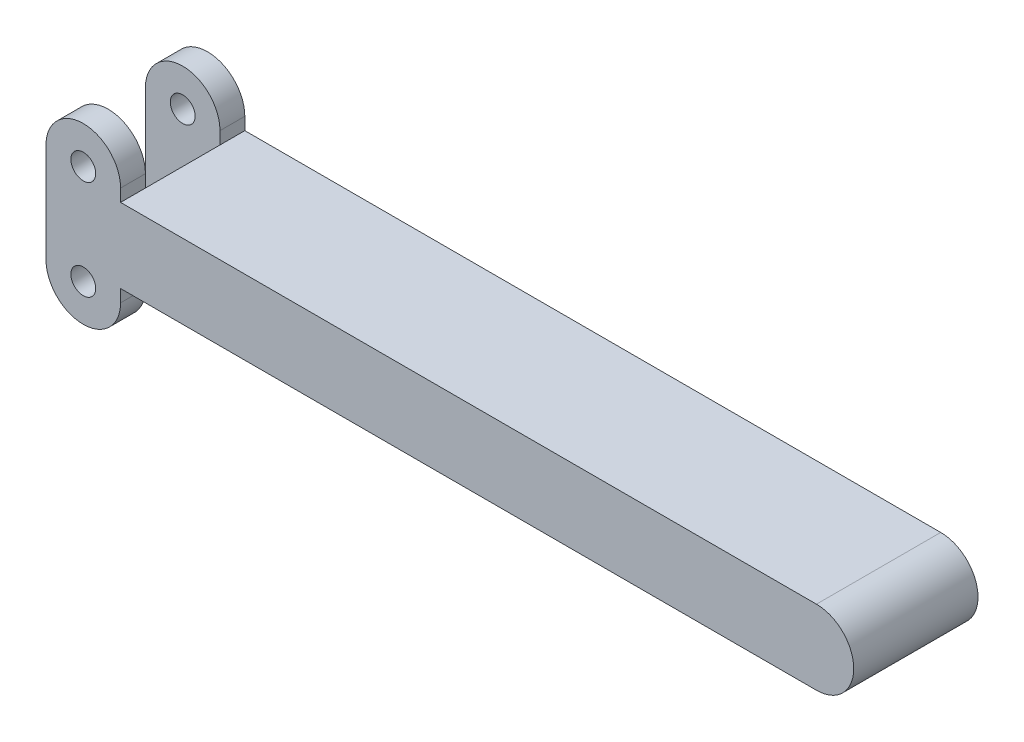
ISO-10303-21;
HEADER;
FILE_DESCRIPTION(('STEP AP214'),'2;1');
FILE_NAME('part.step','',(''),(''),'','','');
FILE_SCHEMA(('AUTOMOTIVE_DESIGN { 1 0 10303 214 1 1 1 1 }'));
ENDSEC;
DATA;
#1=APPLICATION_CONTEXT('core data for automotive mechanical design processes');
#2=APPLICATION_PROTOCOL_DEFINITION('international standard','automotive_design',2000,#1);
#3=PRODUCT_CONTEXT('',#1,'mechanical');
#4=PRODUCT('Part','Part','',(#3));
#5=PRODUCT_RELATED_PRODUCT_CATEGORY('part','',(#4));
#6=PRODUCT_DEFINITION_FORMATION('','',#4);
#7=PRODUCT_DEFINITION_CONTEXT('part definition',#1,'design');
#8=PRODUCT_DEFINITION('design','',#6,#7);
#9=PRODUCT_DEFINITION_SHAPE('','',#8);
#10=(LENGTH_UNIT() NAMED_UNIT(*) SI_UNIT(.MILLI.,.METRE.));
#11=(NAMED_UNIT(*) PLANE_ANGLE_UNIT() SI_UNIT($,.RADIAN.));
#12=(NAMED_UNIT(*) SI_UNIT($,.STERADIAN.) SOLID_ANGLE_UNIT());
#13=UNCERTAINTY_MEASURE_WITH_UNIT(LENGTH_MEASURE(1.E-05),#10,'distance_accuracy_value','');
#14=(GEOMETRIC_REPRESENTATION_CONTEXT(3) GLOBAL_UNCERTAINTY_ASSIGNED_CONTEXT((#13)) GLOBAL_UNIT_ASSIGNED_CONTEXT((#10,
#11,#12)) REPRESENTATION_CONTEXT('',''));
#15=CARTESIAN_POINT('',(0.,0.,0.));
#16=DIRECTION('',(0.,0.,1.));
#17=DIRECTION('',(1.,0.,0.));
#18=AXIS2_PLACEMENT_3D('',#15,#16,#17);
#19=CARTESIAN_POINT('',(9.525,0.,31.75));
#20=DIRECTION('',(-1.,0.,0.));
#21=DIRECTION('',(0.,-1.,0.));
#22=AXIS2_PLACEMENT_3D('',#19,#20,#21);
#23=PLANE('',#22);
#24=DIRECTION('',(0.,-1.,0.));
#25=VECTOR('',#24,1.);
#26=CARTESIAN_POINT('',(9.525,0.,25.4));
#27=LINE('',#26,#25);
#28=CARTESIAN_POINT('',(9.525,25.4,25.4));
#29=VERTEX_POINT('',#28);
#30=CARTESIAN_POINT('',(9.525,22.225,25.4));
#31=VERTEX_POINT('',#30);
#32=EDGE_CURVE('E187',#29,#31,#27,.T.);
#33=ORIENTED_EDGE('',*,*,#32,.F.);
#34=DIRECTION('',(0.,0.,-1.));
#35=VECTOR('',#34,1.);
#36=CARTESIAN_POINT('',(9.525,25.4,31.75));
#37=LINE('',#36,#35);
#38=CARTESIAN_POINT('',(9.525,25.4,31.75));
#39=VERTEX_POINT('',#38);
#40=EDGE_CURVE('E212',#39,#29,#37,.T.);
#41=ORIENTED_EDGE('',*,*,#40,.F.);
#42=DIRECTION('',(0.,1.,0.));
#43=VECTOR('',#42,1.);
#44=CARTESIAN_POINT('',(9.525,0.,31.75));
#45=LINE('',#44,#43);
#46=CARTESIAN_POINT('',(9.525,22.225,31.75));
#47=VERTEX_POINT('',#46);
#48=EDGE_CURVE('E140',#47,#39,#45,.T.);
#49=ORIENTED_EDGE('',*,*,#48,.F.);
#50=DIRECTION('',(0.,0.,-1.));
#51=VECTOR('',#50,1.);
#52=CARTESIAN_POINT('',(9.525,22.225,31.75));
#53=LINE('',#52,#51);
#54=EDGE_CURVE('E43',#47,#31,#53,.T.);
#55=ORIENTED_EDGE('',*,*,#54,.T.);
#56=EDGE_LOOP('',(#33,#41,#49,#55));
#57=FACE_BOUND('',#56,.T.);
#58=ADVANCED_FACE('F34',(#57),#23,.F.);
#59=CARTESIAN_POINT('',(0.,25.4,31.75));
#60=DIRECTION('',(0.,0.,-1.));
#61=DIRECTION('',(-1.,0.,0.));
#62=AXIS2_PLACEMENT_3D('',#59,#60,#61);
#63=CYLINDRICAL_SURFACE('',#62,9.525);
#64=CARTESIAN_POINT('',(0.,25.4,25.4));
#65=DIRECTION('',(0.,0.,-1.));
#66=DIRECTION('',(0.,1.,0.));
#67=AXIS2_PLACEMENT_3D('',#64,#65,#66);
#68=CIRCLE('',#67,9.525);
#69=CARTESIAN_POINT('',(-9.525,25.4,25.4));
#70=VERTEX_POINT('',#69);
#71=EDGE_CURVE('E160',#70,#29,#68,.T.);
#72=ORIENTED_EDGE('',*,*,#71,.F.);
#73=DIRECTION('',(0.,0.,-1.));
#74=VECTOR('',#73,1.);
#75=CARTESIAN_POINT('',(-9.52500000000001,25.4,31.75));
#76=LINE('',#75,#74);
#77=CARTESIAN_POINT('',(-9.52500000000001,25.4,31.75));
#78=VERTEX_POINT('',#77);
#79=EDGE_CURVE('E258',#78,#70,#76,.T.);
#80=ORIENTED_EDGE('',*,*,#79,.F.);
#81=CARTESIAN_POINT('',(0.,25.4,31.75));
#82=DIRECTION('',(0.,0.,1.));
#83=DIRECTION('',(1.,0.,0.));
#84=AXIS2_PLACEMENT_3D('',#81,#82,#83);
#85=CIRCLE('',#84,9.525);
#86=EDGE_CURVE('E145',#39,#78,#85,.T.);
#87=ORIENTED_EDGE('',*,*,#86,.F.);
#88=ORIENTED_EDGE('',*,*,#40,.T.);
#89=EDGE_LOOP('',(#72,#80,#87,#88));
#90=FACE_BOUND('',#89,.T.);
#91=ADVANCED_FACE('F314',(#90),#63,.T.);
#92=CARTESIAN_POINT('',(0.,25.4,6.35));
#93=DIRECTION('',(0.,0.,-1.));
#94=DIRECTION('',(0.,1.,0.));
#95=AXIS2_PLACEMENT_3D('',#92,#93,#94);
#96=CIRCLE('',#95,9.525);
#97=CARTESIAN_POINT('',(-9.525,25.4,6.35));
#98=VERTEX_POINT('',#97);
#99=CARTESIAN_POINT('',(9.525,25.4,6.35));
#100=VERTEX_POINT('',#99);
#101=EDGE_CURVE('E167',#98,#100,#96,.T.);
#102=ORIENTED_EDGE('',*,*,#101,.T.);
#103=CARTESIAN_POINT('',(9.525,25.4,0.));
#104=VERTEX_POINT('',#103);
#105=EDGE_CURVE('E226',#100,#104,#37,.T.);
#106=ORIENTED_EDGE('',*,*,#105,.T.);
#107=CARTESIAN_POINT('',(0.,25.4,0.));
#108=DIRECTION('',(0.,0.,1.));
#109=DIRECTION('',(1.,0.,0.));
#110=AXIS2_PLACEMENT_3D('',#107,#108,#109);
#111=CIRCLE('',#110,9.525);
#112=CARTESIAN_POINT('',(-9.52500000000001,25.4,0.));
#113=VERTEX_POINT('',#112);
#114=EDGE_CURVE('E270',#104,#113,#111,.T.);
#115=ORIENTED_EDGE('',*,*,#114,.T.);
#116=EDGE_CURVE('E257',#98,#113,#76,.T.);
#117=ORIENTED_EDGE('',*,*,#116,.F.);
#118=EDGE_LOOP('',(#102,#106,#115,#117));
#119=FACE_BOUND('',#118,.T.);
#120=ADVANCED_FACE('F271',(#119),#63,.T.);
#121=CARTESIAN_POINT('',(-9.525,0.,31.75));
#122=DIRECTION('',(-1.,0.,0.));
#123=DIRECTION('',(0.,-1.,0.));
#124=AXIS2_PLACEMENT_3D('',#121,#122,#123);
#125=PLANE('',#124);
#126=ORIENTED_EDGE('',*,*,#79,.T.);
#127=DIRECTION('',(0.,-1.,0.));
#128=VECTOR('',#127,1.);
#129=CARTESIAN_POINT('',(-9.525,0.,25.4));
#130=LINE('',#129,#128);
#131=CARTESIAN_POINT('',(-9.525,0.,25.4));
#132=VERTEX_POINT('',#131);
#133=EDGE_CURVE('E181',#70,#132,#130,.T.);
#134=ORIENTED_EDGE('',*,*,#133,.T.);
#135=DIRECTION('',(0.,0.,-1.));
#136=VECTOR('',#135,1.);
#137=CARTESIAN_POINT('',(-9.525,0.,31.75));
#138=LINE('',#137,#136);
#139=CARTESIAN_POINT('',(-9.525,0.,31.75));
#140=VERTEX_POINT('',#139);
#141=EDGE_CURVE('E256',#140,#132,#138,.T.);
#142=ORIENTED_EDGE('',*,*,#141,.F.);
#143=DIRECTION('',(0.,1.,0.));
#144=VECTOR('',#143,1.);
#145=CARTESIAN_POINT('',(-9.525,0.,31.75));
#146=LINE('',#145,#144);
#147=EDGE_CURVE('E121',#140,#78,#146,.T.);
#148=ORIENTED_EDGE('',*,*,#147,.T.);
#149=EDGE_LOOP('',(#126,#134,#142,#148));
#150=FACE_BOUND('',#149,.T.);
#151=ADVANCED_FACE('F340',(#150),#125,.T.);
#152=CARTESIAN_POINT('',(0.,0.,31.75));
#153=DIRECTION('',(0.,0.,-1.));
#154=DIRECTION('',(-1.,0.,0.));
#155=AXIS2_PLACEMENT_3D('',#152,#153,#154);
#156=CYLINDRICAL_SURFACE('',#155,9.525);
#157=CARTESIAN_POINT('',(0.,0.,25.4));
#158=DIRECTION('',(0.,0.,-1.));
#159=DIRECTION('',(0.,1.,0.));
#160=AXIS2_PLACEMENT_3D('',#157,#158,#159);
#161=CIRCLE('',#160,9.525);
#162=CARTESIAN_POINT('',(9.525,0.,25.4));
#163=VERTEX_POINT('',#162);
#164=EDGE_CURVE('E130',#163,#132,#161,.T.);
#165=ORIENTED_EDGE('',*,*,#164,.F.);
#166=DIRECTION('',(0.,0.,-1.));
#167=VECTOR('',#166,1.);
#168=CARTESIAN_POINT('',(9.525,0.,31.75));
#169=LINE('',#168,#167);
#170=CARTESIAN_POINT('',(9.525,0.,31.75));
#171=VERTEX_POINT('',#170);
#172=EDGE_CURVE('E127',#171,#163,#169,.T.);
#173=ORIENTED_EDGE('',*,*,#172,.F.);
#174=CARTESIAN_POINT('',(0.,0.,31.75));
#175=DIRECTION('',(0.,0.,1.));
#176=DIRECTION('',(1.,0.,0.));
#177=AXIS2_PLACEMENT_3D('',#174,#175,#176);
#178=CIRCLE('',#177,9.525);
#179=EDGE_CURVE('E113',#140,#171,#178,.T.);
#180=ORIENTED_EDGE('',*,*,#179,.F.);
#181=ORIENTED_EDGE('',*,*,#141,.T.);
#182=EDGE_LOOP('',(#165,#173,#180,#181));
#183=FACE_BOUND('',#182,.T.);
#184=ADVANCED_FACE('F128',(#183),#156,.T.);
#185=CARTESIAN_POINT('',(9.525,3.175,25.4));
#186=VERTEX_POINT('',#185);
#187=EDGE_CURVE('E180',#186,#163,#27,.T.);
#188=ORIENTED_EDGE('',*,*,#187,.F.);
#189=DIRECTION('',(0.,0.,-1.));
#190=VECTOR('',#189,1.);
#191=CARTESIAN_POINT('',(9.525,3.175,31.75));
#192=LINE('',#191,#190);
#193=CARTESIAN_POINT('',(9.525,3.175,31.75));
#194=VERTEX_POINT('',#193);
#195=EDGE_CURVE('E138',#194,#186,#192,.T.);
#196=ORIENTED_EDGE('',*,*,#195,.F.);
#197=EDGE_CURVE('E118',#171,#194,#45,.T.);
#198=ORIENTED_EDGE('',*,*,#197,.F.);
#199=ORIENTED_EDGE('',*,*,#172,.T.);
#200=EDGE_LOOP('',(#188,#196,#198,#199));
#201=FACE_BOUND('',#200,.T.);
#202=ADVANCED_FACE('F136',(#201),#23,.F.);
#203=CARTESIAN_POINT('',(0.,0.,31.75));
#204=DIRECTION('',(0.,0.,-1.));
#205=DIRECTION('',(-1.,0.,0.));
#206=AXIS2_PLACEMENT_3D('',#203,#204,#205);
#207=CYLINDRICAL_SURFACE('',#206,3.175);
#208=CARTESIAN_POINT('',(0.,0.,31.75));
#209=DIRECTION('',(0.,0.,1.));
#210=DIRECTION('',(1.,0.,0.));
#211=AXIS2_PLACEMENT_3D('',#208,#209,#210);
#212=CIRCLE('',#211,3.175);
#213=CARTESIAN_POINT('',(3.175,0.,31.75));
#214=VERTEX_POINT('',#213);
#215=EDGE_CURVE('E141',#214,#214,#212,.T.);
#216=ORIENTED_EDGE('',*,*,#215,.T.);
#217=EDGE_LOOP('',(#216));
#218=FACE_BOUND('',#217,.T.);
#219=CARTESIAN_POINT('',(0.,0.,25.4));
#220=DIRECTION('',(0.,0.,-1.));
#221=DIRECTION('',(0.,1.,0.));
#222=AXIS2_PLACEMENT_3D('',#219,#220,#221);
#223=CIRCLE('',#222,3.175);
#224=CARTESIAN_POINT('',(0.,3.175,25.4));
#225=VERTEX_POINT('',#224);
#226=EDGE_CURVE('E164',#225,#225,#223,.T.);
#227=ORIENTED_EDGE('',*,*,#226,.T.);
#228=EDGE_LOOP('',(#227));
#229=FACE_BOUND('',#228,.T.);
#230=ADVANCED_FACE('F311',(#218,#229),#207,.F.);
#231=CARTESIAN_POINT('',(0.,25.4,31.75));
#232=DIRECTION('',(0.,0.,-1.));
#233=DIRECTION('',(-1.,0.,0.));
#234=AXIS2_PLACEMENT_3D('',#231,#232,#233);
#235=CYLINDRICAL_SURFACE('',#234,3.175);
#236=CARTESIAN_POINT('',(0.,25.4,31.75));
#237=DIRECTION('',(0.,0.,1.));
#238=DIRECTION('',(1.,0.,0.));
#239=AXIS2_PLACEMENT_3D('',#236,#237,#238);
#240=CIRCLE('',#239,3.175);
#241=CARTESIAN_POINT('',(3.17499999999999,25.4,31.75));
#242=VERTEX_POINT('',#241);
#243=EDGE_CURVE('E352',#242,#242,#240,.T.);
#244=ORIENTED_EDGE('',*,*,#243,.T.);
#245=EDGE_LOOP('',(#244));
#246=FACE_BOUND('',#245,.T.);
#247=CARTESIAN_POINT('',(0.,25.4,25.4));
#248=DIRECTION('',(0.,0.,-1.));
#249=DIRECTION('',(0.,1.,0.));
#250=AXIS2_PLACEMENT_3D('',#247,#248,#249);
#251=CIRCLE('',#250,3.175);
#252=CARTESIAN_POINT('',(0.,28.575,25.4));
#253=VERTEX_POINT('',#252);
#254=EDGE_CURVE('E38',#253,#253,#251,.T.);
#255=ORIENTED_EDGE('',*,*,#254,.T.);
#256=EDGE_LOOP('',(#255));
#257=FACE_BOUND('',#256,.T.);
#258=ADVANCED_FACE('F300',(#246,#257),#235,.F.);
#259=CARTESIAN_POINT('',(187.325,12.7,31.75));
#260=DIRECTION('',(0.,0.,-1.));
#261=DIRECTION('',(-1.,0.,0.));
#262=AXIS2_PLACEMENT_3D('',#259,#260,#261);
#263=CYLINDRICAL_SURFACE('',#262,9.525);
#264=CARTESIAN_POINT('',(187.325,12.7,0.));
#265=DIRECTION('',(0.,0.,1.));
#266=DIRECTION('',(1.,0.,0.));
#267=AXIS2_PLACEMENT_3D('',#264,#265,#266);
#268=CIRCLE('',#267,9.525);
#269=CARTESIAN_POINT('',(187.325,22.225,0.));
#270=VERTEX_POINT('',#269);
#271=CARTESIAN_POINT('',(187.325,3.175,0.));
#272=VERTEX_POINT('',#271);
#273=EDGE_CURVE('E159',#270,#272,#268,.F.);
#274=ORIENTED_EDGE('',*,*,#273,.F.);
#275=DIRECTION('',(0.,0.,-1.));
#276=VECTOR('',#275,1.);
#277=CARTESIAN_POINT('',(187.325,22.225,31.75));
#278=LINE('',#277,#276);
#279=CARTESIAN_POINT('',(187.325,22.225,31.75));
#280=VERTEX_POINT('',#279);
#281=EDGE_CURVE('E11',#280,#270,#278,.T.);
#282=ORIENTED_EDGE('',*,*,#281,.F.);
#283=CARTESIAN_POINT('',(187.325,12.7,31.75));
#284=DIRECTION('',(0.,0.,1.));
#285=DIRECTION('',(1.,0.,0.));
#286=AXIS2_PLACEMENT_3D('',#283,#284,#285);
#287=CIRCLE('',#286,9.525);
#288=CARTESIAN_POINT('',(187.325,3.175,31.75));
#289=VERTEX_POINT('',#288);
#290=EDGE_CURVE('E151',#280,#289,#287,.F.);
#291=ORIENTED_EDGE('',*,*,#290,.T.);
#292=DIRECTION('',(0.,0.,-1.));
#293=VECTOR('',#292,1.);
#294=CARTESIAN_POINT('',(187.325,3.175,31.75));
#295=LINE('',#294,#293);
#296=EDGE_CURVE('E92',#289,#272,#295,.T.);
#297=ORIENTED_EDGE('',*,*,#296,.T.);
#298=EDGE_LOOP('',(#274,#282,#291,#297));
#299=FACE_BOUND('',#298,.T.);
#300=ADVANCED_FACE('F36',(#299),#263,.T.);
#301=CARTESIAN_POINT('',(0.,22.225,31.75));
#302=DIRECTION('',(0.,1.,0.));
#303=DIRECTION('',(0.,0.,1.));
#304=AXIS2_PLACEMENT_3D('',#301,#302,#303);
#305=PLANE('',#304);
#306=DIRECTION('',(1.,0.,0.));
#307=VECTOR('',#306,1.);
#308=CARTESIAN_POINT('',(0.,22.225,0.));
#309=LINE('',#308,#307);
#310=CARTESIAN_POINT('',(9.525,22.225,0.));
#311=VERTEX_POINT('',#310);
#312=EDGE_CURVE('E348',#311,#270,#309,.T.);
#313=ORIENTED_EDGE('',*,*,#312,.F.);
#314=CARTESIAN_POINT('',(9.525,22.225,6.35));
#315=VERTEX_POINT('',#314);
#316=EDGE_CURVE('E210',#315,#311,#53,.T.);
#317=ORIENTED_EDGE('',*,*,#316,.F.);
#318=DIRECTION('',(0.,0.,1.));
#319=VECTOR('',#318,1.);
#320=CARTESIAN_POINT('',(9.525,22.225,31.75));
#321=LINE('',#320,#319);
#322=EDGE_CURVE('E156',#315,#31,#321,.T.);
#323=ORIENTED_EDGE('',*,*,#322,.T.);
#324=ORIENTED_EDGE('',*,*,#54,.F.);
#325=DIRECTION('',(1.,0.,0.));
#326=VECTOR('',#325,1.);
#327=CARTESIAN_POINT('',(0.,22.225,31.75));
#328=LINE('',#327,#326);
#329=EDGE_CURVE('E146',#47,#280,#328,.T.);
#330=ORIENTED_EDGE('',*,*,#329,.T.);
#331=ORIENTED_EDGE('',*,*,#281,.T.);
#332=EDGE_LOOP('',(#313,#317,#323,#324,#330,#331));
#333=FACE_BOUND('',#332,.T.);
#334=ADVANCED_FACE('F208',(#333),#305,.T.);
#335=ORIENTED_EDGE('',*,*,#105,.F.);
#336=DIRECTION('',(0.,-1.,0.));
#337=VECTOR('',#336,1.);
#338=CARTESIAN_POINT('',(9.525,0.,6.35));
#339=LINE('',#338,#337);
#340=EDGE_CURVE('E188',#100,#315,#339,.T.);
#341=ORIENTED_EDGE('',*,*,#340,.T.);
#342=ORIENTED_EDGE('',*,*,#316,.T.);
#343=DIRECTION('',(0.,1.,0.));
#344=VECTOR('',#343,1.);
#345=CARTESIAN_POINT('',(9.525,0.,0.));
#346=LINE('',#345,#344);
#347=EDGE_CURVE('E273',#311,#104,#346,.T.);
#348=ORIENTED_EDGE('',*,*,#347,.T.);
#349=EDGE_LOOP('',(#335,#341,#342,#348));
#350=FACE_BOUND('',#349,.T.);
#351=ADVANCED_FACE('F222',(#350),#23,.F.);
#352=DIRECTION('',(0.,-1.,0.));
#353=VECTOR('',#352,1.);
#354=CARTESIAN_POINT('',(-9.525,0.,6.35));
#355=LINE('',#354,#353);
#356=CARTESIAN_POINT('',(-9.525,0.,6.35));
#357=VERTEX_POINT('',#356);
#358=EDGE_CURVE('E177',#98,#357,#355,.T.);
#359=ORIENTED_EDGE('',*,*,#358,.F.);
#360=ORIENTED_EDGE('',*,*,#116,.T.);
#361=DIRECTION('',(0.,1.,0.));
#362=VECTOR('',#361,1.);
#363=CARTESIAN_POINT('',(-9.525,0.,0.));
#364=LINE('',#363,#362);
#365=CARTESIAN_POINT('',(-9.525,0.,0.));
#366=VERTEX_POINT('',#365);
#367=EDGE_CURVE('E268',#366,#113,#364,.T.);
#368=ORIENTED_EDGE('',*,*,#367,.F.);
#369=EDGE_CURVE('E133',#357,#366,#138,.T.);
#370=ORIENTED_EDGE('',*,*,#369,.F.);
#371=EDGE_LOOP('',(#359,#360,#368,#370));
#372=FACE_BOUND('',#371,.T.);
#373=ADVANCED_FACE('F265',(#372),#125,.T.);
#374=CARTESIAN_POINT('',(9.525,0.,6.35));
#375=VERTEX_POINT('',#374);
#376=CARTESIAN_POINT('',(9.525,0.,0.));
#377=VERTEX_POINT('',#376);
#378=EDGE_CURVE('E134',#375,#377,#169,.T.);
#379=ORIENTED_EDGE('',*,*,#378,.F.);
#380=CARTESIAN_POINT('',(0.,0.,6.35));
#381=DIRECTION('',(0.,0.,-1.));
#382=DIRECTION('',(0.,1.,0.));
#383=AXIS2_PLACEMENT_3D('',#380,#381,#382);
#384=CIRCLE('',#383,9.525);
#385=EDGE_CURVE('E170',#375,#357,#384,.T.);
#386=ORIENTED_EDGE('',*,*,#385,.T.);
#387=ORIENTED_EDGE('',*,*,#369,.T.);
#388=CARTESIAN_POINT('',(0.,0.,0.));
#389=DIRECTION('',(0.,0.,1.));
#390=DIRECTION('',(1.,0.,0.));
#391=AXIS2_PLACEMENT_3D('',#388,#389,#390);
#392=CIRCLE('',#391,9.525);
#393=EDGE_CURVE('E281',#366,#377,#392,.T.);
#394=ORIENTED_EDGE('',*,*,#393,.T.);
#395=EDGE_LOOP('',(#379,#386,#387,#394));
#396=FACE_BOUND('',#395,.T.);
#397=ADVANCED_FACE('F325',(#396),#156,.T.);
#398=CARTESIAN_POINT('',(9.525,3.175,6.35));
#399=VERTEX_POINT('',#398);
#400=CARTESIAN_POINT('',(9.525,3.175,0.));
#401=VERTEX_POINT('',#400);
#402=EDGE_CURVE('E251',#399,#401,#192,.T.);
#403=ORIENTED_EDGE('',*,*,#402,.F.);
#404=EDGE_CURVE('E184',#399,#375,#339,.T.);
#405=ORIENTED_EDGE('',*,*,#404,.T.);
#406=ORIENTED_EDGE('',*,*,#378,.T.);
#407=EDGE_CURVE('E283',#377,#401,#346,.T.);
#408=ORIENTED_EDGE('',*,*,#407,.T.);
#409=EDGE_LOOP('',(#403,#405,#406,#408));
#410=FACE_BOUND('',#409,.T.);
#411=ADVANCED_FACE('F316',(#410),#23,.F.);
#412=CARTESIAN_POINT('',(0.,0.,6.35));
#413=DIRECTION('',(0.,0.,-1.));
#414=DIRECTION('',(0.,1.,0.));
#415=AXIS2_PLACEMENT_3D('',#412,#413,#414);
#416=CIRCLE('',#415,3.175);
#417=CARTESIAN_POINT('',(0.,3.175,6.35));
#418=VERTEX_POINT('',#417);
#419=EDGE_CURVE('E173',#418,#418,#416,.T.);
#420=ORIENTED_EDGE('',*,*,#419,.F.);
#421=EDGE_LOOP('',(#420));
#422=FACE_BOUND('',#421,.T.);
#423=CARTESIAN_POINT('',(0.,0.,0.));
#424=DIRECTION('',(0.,0.,1.));
#425=DIRECTION('',(1.,0.,0.));
#426=AXIS2_PLACEMENT_3D('',#423,#424,#425);
#427=CIRCLE('',#426,3.175);
#428=CARTESIAN_POINT('',(3.175,0.,0.));
#429=VERTEX_POINT('',#428);
#430=EDGE_CURVE('E289',#429,#429,#427,.T.);
#431=ORIENTED_EDGE('',*,*,#430,.F.);
#432=EDGE_LOOP('',(#431));
#433=FACE_BOUND('',#432,.T.);
#434=ADVANCED_FACE('F306',(#422,#433),#207,.F.);
#435=CARTESIAN_POINT('',(0.,3.175,31.75));
#436=DIRECTION('',(0.,1.,0.));
#437=DIRECTION('',(0.,0.,1.));
#438=AXIS2_PLACEMENT_3D('',#435,#436,#437);
#439=PLANE('',#438);
#440=DIRECTION('',(1.,0.,0.));
#441=VECTOR('',#440,1.);
#442=CARTESIAN_POINT('',(0.,3.175,0.));
#443=LINE('',#442,#441);
#444=EDGE_CURVE('E287',#401,#272,#443,.T.);
#445=ORIENTED_EDGE('',*,*,#444,.T.);
#446=ORIENTED_EDGE('',*,*,#296,.F.);
#447=DIRECTION('',(1.,0.,0.));
#448=VECTOR('',#447,1.);
#449=CARTESIAN_POINT('',(0.,3.175,31.75));
#450=LINE('',#449,#448);
#451=EDGE_CURVE('E60',#194,#289,#450,.T.);
#452=ORIENTED_EDGE('',*,*,#451,.F.);
#453=ORIENTED_EDGE('',*,*,#195,.T.);
#454=EDGE_CURVE('E248',#186,#399,#192,.T.);
#455=ORIENTED_EDGE('',*,*,#454,.T.);
#456=ORIENTED_EDGE('',*,*,#402,.T.);
#457=EDGE_LOOP('',(#445,#446,#452,#453,#455,#456));
#458=FACE_BOUND('',#457,.T.);
#459=ADVANCED_FACE('F297',(#458),#439,.F.);
#460=CARTESIAN_POINT('',(0.,25.4,6.35));
#461=DIRECTION('',(0.,0.,-1.));
#462=DIRECTION('',(0.,1.,0.));
#463=AXIS2_PLACEMENT_3D('',#460,#461,#462);
#464=CIRCLE('',#463,3.175);
#465=CARTESIAN_POINT('',(0.,28.575,6.35));
#466=VERTEX_POINT('',#465);
#467=EDGE_CURVE('E176',#466,#466,#464,.T.);
#468=ORIENTED_EDGE('',*,*,#467,.F.);
#469=EDGE_LOOP('',(#468));
#470=FACE_BOUND('',#469,.T.);
#471=CARTESIAN_POINT('',(0.,25.4,0.));
#472=DIRECTION('',(0.,0.,1.));
#473=DIRECTION('',(1.,0.,0.));
#474=AXIS2_PLACEMENT_3D('',#471,#472,#473);
#475=CIRCLE('',#474,3.175);
#476=CARTESIAN_POINT('',(3.17499999999999,25.4,0.));
#477=VERTEX_POINT('',#476);
#478=EDGE_CURVE('E153',#477,#477,#475,.T.);
#479=ORIENTED_EDGE('',*,*,#478,.F.);
#480=EDGE_LOOP('',(#479));
#481=FACE_BOUND('',#480,.T.);
#482=ADVANCED_FACE('F295',(#470,#481),#235,.F.);
#483=CARTESIAN_POINT('',(0.,0.,31.75));
#484=DIRECTION('',(0.,0.,1.));
#485=DIRECTION('',(1.,0.,0.));
#486=AXIS2_PLACEMENT_3D('',#483,#484,#485);
#487=PLANE('',#486);
#488=ORIENTED_EDGE('',*,*,#290,.F.);
#489=ORIENTED_EDGE('',*,*,#329,.F.);
#490=ORIENTED_EDGE('',*,*,#48,.T.);
#491=ORIENTED_EDGE('',*,*,#86,.T.);
#492=ORIENTED_EDGE('',*,*,#147,.F.);
#493=ORIENTED_EDGE('',*,*,#179,.T.);
#494=ORIENTED_EDGE('',*,*,#197,.T.);
#495=ORIENTED_EDGE('',*,*,#451,.T.);
#496=EDGE_LOOP('',(#488,#489,#490,#491,#492,#493,#494,#495));
#497=FACE_BOUND('',#496,.T.);
#498=ORIENTED_EDGE('',*,*,#215,.F.);
#499=EDGE_LOOP('',(#498));
#500=FACE_BOUND('',#499,.T.);
#501=ORIENTED_EDGE('',*,*,#243,.F.);
#502=EDGE_LOOP('',(#501));
#503=FACE_BOUND('',#502,.T.);
#504=ADVANCED_FACE('F115',(#497,#500,#503),#487,.T.);
#505=CARTESIAN_POINT('',(0.,0.,0.));
#506=DIRECTION('',(0.,0.,1.));
#507=DIRECTION('',(1.,0.,0.));
#508=AXIS2_PLACEMENT_3D('',#505,#506,#507);
#509=PLANE('',#508);
#510=ORIENTED_EDGE('',*,*,#273,.T.);
#511=ORIENTED_EDGE('',*,*,#444,.F.);
#512=ORIENTED_EDGE('',*,*,#407,.F.);
#513=ORIENTED_EDGE('',*,*,#393,.F.);
#514=ORIENTED_EDGE('',*,*,#367,.T.);
#515=ORIENTED_EDGE('',*,*,#114,.F.);
#516=ORIENTED_EDGE('',*,*,#347,.F.);
#517=ORIENTED_EDGE('',*,*,#312,.T.);
#518=EDGE_LOOP('',(#510,#511,#512,#513,#514,#515,#516,#517));
#519=FACE_BOUND('',#518,.T.);
#520=ORIENTED_EDGE('',*,*,#430,.T.);
#521=EDGE_LOOP('',(#520));
#522=FACE_BOUND('',#521,.T.);
#523=ORIENTED_EDGE('',*,*,#478,.T.);
#524=EDGE_LOOP('',(#523));
#525=FACE_BOUND('',#524,.T.);
#526=ADVANCED_FACE('F277',(#519,#522,#525),#509,.F.);
#527=CARTESIAN_POINT('',(9.525,0.,0.));
#528=DIRECTION('',(-1.,0.,0.));
#529=DIRECTION('',(0.,0.,1.));
#530=AXIS2_PLACEMENT_3D('',#527,#528,#529);
#531=PLANE('',#530);
#532=EDGE_CURVE('E51',#315,#399,#339,.T.);
#533=ORIENTED_EDGE('',*,*,#532,.T.);
#534=ORIENTED_EDGE('',*,*,#454,.F.);
#535=EDGE_CURVE('E190',#31,#186,#27,.T.);
#536=ORIENTED_EDGE('',*,*,#535,.F.);
#537=ORIENTED_EDGE('',*,*,#322,.F.);
#538=EDGE_LOOP('',(#533,#534,#536,#537));
#539=FACE_BOUND('',#538,.T.);
#540=ADVANCED_FACE('F249',(#539),#531,.T.);
#541=CARTESIAN_POINT('',(9.525,0.,25.4));
#542=DIRECTION('',(0.,0.,-1.));
#543=DIRECTION('',(0.,1.,0.));
#544=AXIS2_PLACEMENT_3D('',#541,#542,#543);
#545=PLANE('',#544);
#546=ORIENTED_EDGE('',*,*,#226,.F.);
#547=EDGE_LOOP('',(#546));
#548=FACE_BOUND('',#547,.T.);
#549=ORIENTED_EDGE('',*,*,#254,.F.);
#550=EDGE_LOOP('',(#549));
#551=FACE_BOUND('',#550,.T.);
#552=ORIENTED_EDGE('',*,*,#71,.T.);
#553=ORIENTED_EDGE('',*,*,#32,.T.);
#554=ORIENTED_EDGE('',*,*,#535,.T.);
#555=ORIENTED_EDGE('',*,*,#187,.T.);
#556=ORIENTED_EDGE('',*,*,#164,.T.);
#557=ORIENTED_EDGE('',*,*,#133,.F.);
#558=EDGE_LOOP('',(#552,#553,#554,#555,#556,#557));
#559=FACE_BOUND('',#558,.T.);
#560=ADVANCED_FACE('F196',(#548,#551,#559),#545,.T.);
#561=CARTESIAN_POINT('',(9.525,0.,6.35));
#562=DIRECTION('',(0.,0.,-1.));
#563=DIRECTION('',(0.,1.,0.));
#564=AXIS2_PLACEMENT_3D('',#561,#562,#563);
#565=PLANE('',#564);
#566=ORIENTED_EDGE('',*,*,#419,.T.);
#567=EDGE_LOOP('',(#566));
#568=FACE_BOUND('',#567,.T.);
#569=ORIENTED_EDGE('',*,*,#467,.T.);
#570=EDGE_LOOP('',(#569));
#571=FACE_BOUND('',#570,.T.);
#572=ORIENTED_EDGE('',*,*,#101,.F.);
#573=ORIENTED_EDGE('',*,*,#358,.T.);
#574=ORIENTED_EDGE('',*,*,#385,.F.);
#575=ORIENTED_EDGE('',*,*,#404,.F.);
#576=ORIENTED_EDGE('',*,*,#532,.F.);
#577=ORIENTED_EDGE('',*,*,#340,.F.);
#578=EDGE_LOOP('',(#572,#573,#574,#575,#576,#577));
#579=FACE_BOUND('',#578,.T.);
#580=ADVANCED_FACE('F231',(#568,#571,#579),#565,.F.);
#581=CLOSED_SHELL('',(#58,#91,#120,#151,#184,#202,#230,#258,#300,#334,#351,#373,#397,#411,#434,
#459,#482,#504,#526,#540,#560,#580));
#582=MANIFOLD_SOLID_BREP('B2',#581);
#583=ADVANCED_BREP_SHAPE_REPRESENTATION('',(#18,#582),#14);
#584=SHAPE_DEFINITION_REPRESENTATION(#9,#583);
ENDSEC;
END-ISO-10303-21;
